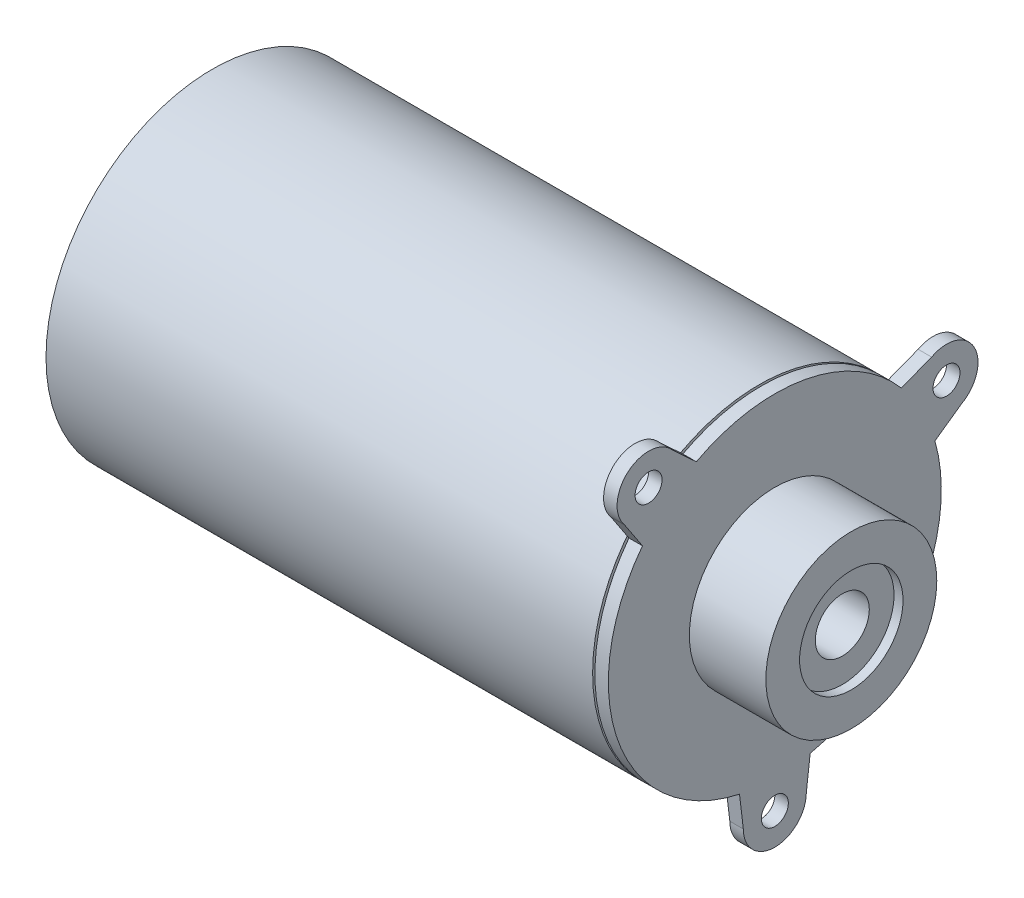
ISO-10303-21;
HEADER;
FILE_DESCRIPTION(('STEP AP214'),'2;1');
FILE_NAME('part.step','',(''),(''),'','','');
FILE_SCHEMA(('AUTOMOTIVE_DESIGN { 1 0 10303 214 1 1 1 1 }'));
ENDSEC;
DATA;
#1=APPLICATION_CONTEXT('core data for automotive mechanical design processes');
#2=APPLICATION_PROTOCOL_DEFINITION('international standard','automotive_design',2000,#1);
#3=PRODUCT_CONTEXT('',#1,'mechanical');
#4=PRODUCT('Part','Part','',(#3));
#5=PRODUCT_RELATED_PRODUCT_CATEGORY('part','',(#4));
#6=PRODUCT_DEFINITION_FORMATION('','',#4);
#7=PRODUCT_DEFINITION_CONTEXT('part definition',#1,'design');
#8=PRODUCT_DEFINITION('design','',#6,#7);
#9=PRODUCT_DEFINITION_SHAPE('','',#8);
#10=(LENGTH_UNIT() NAMED_UNIT(*) SI_UNIT(.MILLI.,.METRE.));
#11=(NAMED_UNIT(*) PLANE_ANGLE_UNIT() SI_UNIT($,.RADIAN.));
#12=(NAMED_UNIT(*) SI_UNIT($,.STERADIAN.) SOLID_ANGLE_UNIT());
#13=UNCERTAINTY_MEASURE_WITH_UNIT(LENGTH_MEASURE(1.E-05),#10,'distance_accuracy_value','');
#14=(GEOMETRIC_REPRESENTATION_CONTEXT(3) GLOBAL_UNCERTAINTY_ASSIGNED_CONTEXT((#13)) GLOBAL_UNIT_ASSIGNED_CONTEXT((#10,
#11,#12)) REPRESENTATION_CONTEXT('',''));
#15=CARTESIAN_POINT('',(0.,0.,0.));
#16=DIRECTION('',(0.,0.,1.));
#17=DIRECTION('',(1.,0.,0.));
#18=AXIS2_PLACEMENT_3D('',#15,#16,#17);
#19=CARTESIAN_POINT('',(1.5,0.,0.));
#20=DIRECTION('',(-1.,0.,0.));
#21=DIRECTION('',(0.,0.,1.));
#22=AXIS2_PLACEMENT_3D('',#19,#20,#21);
#23=CYLINDRICAL_SURFACE('',#22,18.5);
#24=CARTESIAN_POINT('',(-0.25,0.,0.));
#25=DIRECTION('',(1.,0.,0.));
#26=DIRECTION('',(0.,0.,-1.));
#27=AXIS2_PLACEMENT_3D('',#24,#25,#26);
#28=CIRCLE('',#27,18.5);
#29=CARTESIAN_POINT('',(-0.25,0.,-18.5));
#30=VERTEX_POINT('',#29);
#31=EDGE_CURVE('E208',#30,#30,#28,.T.);
#32=ORIENTED_EDGE('',*,*,#31,.F.);
#33=EDGE_LOOP('',(#32));
#34=FACE_BOUND('',#33,.T.);
#35=CARTESIAN_POINT('',(-61.,0.,0.));
#36=DIRECTION('',(-1.,0.,0.));
#37=DIRECTION('',(0.,0.,1.));
#38=AXIS2_PLACEMENT_3D('',#35,#36,#37);
#39=CIRCLE('',#38,18.5);
#40=CARTESIAN_POINT('',(-61.,0.,18.5));
#41=VERTEX_POINT('',#40);
#42=EDGE_CURVE('E576',#41,#41,#39,.T.);
#43=ORIENTED_EDGE('',*,*,#42,.F.);
#44=EDGE_LOOP('',(#43));
#45=FACE_BOUND('',#44,.T.);
#46=ADVANCED_FACE('F35',(#34,#45),#23,.T.);
#47=CARTESIAN_POINT('',(-55.5,0.,0.));
#48=DIRECTION('',(-1.,0.,0.));
#49=DIRECTION('',(0.,0.,1.));
#50=AXIS2_PLACEMENT_3D('',#47,#48,#49);
#51=CYLINDRICAL_SURFACE('',#50,17.5);
#52=CARTESIAN_POINT('',(-55.5,0.,0.));
#53=DIRECTION('',(1.,0.,0.));
#54=DIRECTION('',(0.,0.,-1.));
#55=AXIS2_PLACEMENT_3D('',#52,#53,#54);
#56=CIRCLE('',#55,17.5);
#57=CARTESIAN_POINT('',(-55.5,0.,-17.5));
#58=VERTEX_POINT('',#57);
#59=EDGE_CURVE('E153',#58,#58,#56,.T.);
#60=ORIENTED_EDGE('',*,*,#59,.T.);
#61=EDGE_LOOP('',(#60));
#62=FACE_BOUND('',#61,.T.);
#63=CARTESIAN_POINT('',(-61.,0.,0.));
#64=DIRECTION('',(-1.,0.,0.));
#65=DIRECTION('',(0.,0.,1.));
#66=AXIS2_PLACEMENT_3D('',#63,#64,#65);
#67=CIRCLE('',#66,17.5);
#68=CARTESIAN_POINT('',(-61.,0.,17.5));
#69=VERTEX_POINT('',#68);
#70=EDGE_CURVE('E39',#69,#69,#67,.T.);
#71=ORIENTED_EDGE('',*,*,#70,.T.);
#72=EDGE_LOOP('',(#71));
#73=FACE_BOUND('',#72,.T.);
#74=ADVANCED_FACE('F314',(#62,#73),#51,.F.);
#75=DIRECTION('',(-1.,0.,0.));
#76=VECTOR('',#75,1.);
#77=CARTESIAN_POINT('',(1.5,12.0220592013909,-14.0612976840067));
#78=LINE('',#77,#76);
#79=CARTESIAN_POINT('',(1.5,12.0220592013909,-14.0612976840067));
#80=VERTEX_POINT('',#79);
#81=CARTESIAN_POINT('',(0.,12.0220592013909,-14.0612976840067));
#82=VERTEX_POINT('',#81);
#83=EDGE_CURVE('E196',#80,#82,#78,.T.);
#84=ORIENTED_EDGE('',*,*,#83,.T.);
#85=CARTESIAN_POINT('',(0.,0.,0.));
#86=DIRECTION('',(1.,0.,0.));
#87=DIRECTION('',(0.,0.,-1.));
#88=AXIS2_PLACEMENT_3D('',#85,#86,#87);
#89=CIRCLE('',#88,18.5);
#90=CARTESIAN_POINT('',(0.,16.3147658101459,8.72229422572375));
#91=VERTEX_POINT('',#90);
#92=EDGE_CURVE('E215',#82,#91,#89,.T.);
#93=ORIENTED_EDGE('',*,*,#92,.T.);
#94=DIRECTION('',(-1.,0.,0.));
#95=VECTOR('',#94,1.);
#96=CARTESIAN_POINT('',(1.5,16.3147658101459,8.72229422572375));
#97=LINE('',#96,#95);
#98=CARTESIAN_POINT('',(1.5,16.3147658101459,8.72229422572375));
#99=VERTEX_POINT('',#98);
#100=EDGE_CURVE('E193',#99,#91,#97,.T.);
#101=ORIENTED_EDGE('',*,*,#100,.F.);
#102=CARTESIAN_POINT('',(1.5,0.,0.));
#103=DIRECTION('',(1.,0.,0.));
#104=DIRECTION('',(0.,0.,-1.));
#105=AXIS2_PLACEMENT_3D('',#102,#103,#104);
#106=CIRCLE('',#105,18.5);
#107=EDGE_CURVE('E240',#80,#99,#106,.T.);
#108=ORIENTED_EDGE('',*,*,#107,.F.);
#109=EDGE_LOOP('',(#84,#93,#101,#108));
#110=FACE_BOUND('',#109,.T.);
#111=ADVANCED_FACE('F259',(#110),#23,.T.);
#112=DIRECTION('',(-1.,0.,0.));
#113=VECTOR('',#112,1.);
#114=CARTESIAN_POINT('',(1.5,11.2185170794891,14.7103662271614));
#115=LINE('',#114,#113);
#116=CARTESIAN_POINT('',(1.5,11.2185170794891,14.7103662271614));
#117=VERTEX_POINT('',#116);
#118=CARTESIAN_POINT('',(0.,11.2185170794891,14.7103662271614));
#119=VERTEX_POINT('',#118);
#120=EDGE_CURVE('E184',#117,#119,#115,.T.);
#121=ORIENTED_EDGE('',*,*,#120,.T.);
#122=CARTESIAN_POINT('',(0.,-18.0782272315908,3.92781111599948));
#123=VERTEX_POINT('',#122);
#124=EDGE_CURVE('E220',#119,#123,#89,.T.);
#125=ORIENTED_EDGE('',*,*,#124,.T.);
#126=DIRECTION('',(-1.,0.,0.));
#127=VECTOR('',#126,1.);
#128=CARTESIAN_POINT('',(1.5,-18.0782272315908,3.92781111599948));
#129=LINE('',#128,#127);
#130=CARTESIAN_POINT('',(1.5,-18.0782272315908,3.92781111599948));
#131=VERTEX_POINT('',#130);
#132=EDGE_CURVE('E132',#131,#123,#129,.T.);
#133=ORIENTED_EDGE('',*,*,#132,.F.);
#134=EDGE_CURVE('E127',#117,#131,#106,.T.);
#135=ORIENTED_EDGE('',*,*,#134,.F.);
#136=EDGE_LOOP('',(#121,#125,#133,#135));
#137=FACE_BOUND('',#136,.T.);
#138=ADVANCED_FACE('F276',(#137),#23,.T.);
#139=CARTESIAN_POINT('',(1.5,-5.03690467349999,-3.57654560553015));
#140=DIRECTION('',(0.,0.815356752268375,0.57895886428171));
#141=DIRECTION('',(0.,-0.57895886428171,0.815356752268375));
#142=AXIS2_PLACEMENT_3D('',#139,#140,#141);
#143=PLANE('',#142);
#144=DIRECTION('',(0.,0.57895886428171,-0.815356752268375));
#145=VECTOR('',#144,1.);
#146=CARTESIAN_POINT('',(0.,-5.03690467349999,-3.57654560553015));
#147=LINE('',#146,#145);
#148=CARTESIAN_POINT('',(0.,5.05904754640385,-17.7948317756371));
#149=VERTEX_POINT('',#148);
#150=CARTESIAN_POINT('',(0.,7.14616197718739,-20.7341474142489));
#151=VERTEX_POINT('',#150);
#152=EDGE_CURVE('E150',#149,#151,#147,.T.);
#153=ORIENTED_EDGE('',*,*,#152,.T.);
#154=DIRECTION('',(-1.,0.,0.));
#155=VECTOR('',#154,1.);
#156=CARTESIAN_POINT('',(1.5,7.14616197718739,-20.7341474142489));
#157=LINE('',#156,#155);
#158=CARTESIAN_POINT('',(1.5,7.14616197718739,-20.7341474142489));
#159=VERTEX_POINT('',#158);
#160=EDGE_CURVE('E202',#159,#151,#157,.T.);
#161=ORIENTED_EDGE('',*,*,#160,.F.);
#162=DIRECTION('',(0.,0.57895886428171,-0.815356752268375));
#163=VECTOR('',#162,1.);
#164=CARTESIAN_POINT('',(1.5,-5.03690467349999,-3.57654560553015));
#165=LINE('',#164,#163);
#166=CARTESIAN_POINT('',(1.5,5.05904754640385,-17.7948317756371));
#167=VERTEX_POINT('',#166);
#168=EDGE_CURVE('E94',#167,#159,#165,.T.);
#169=ORIENTED_EDGE('',*,*,#168,.F.);
#170=DIRECTION('',(-1.,0.,0.));
#171=VECTOR('',#170,1.);
#172=CARTESIAN_POINT('',(1.5,5.05904754640385,-17.7948317756371));
#173=LINE('',#172,#171);
#174=EDGE_CURVE('E45',#167,#149,#173,.T.);
#175=ORIENTED_EDGE('',*,*,#174,.T.);
#176=EDGE_LOOP('',(#153,#161,#169,#175));
#177=FACE_BOUND('',#176,.T.);
#178=ADVANCED_FACE('F37',(#177),#143,.F.);
#179=CARTESIAN_POINT('',(1.5,10.230724059415,-19.0802197372071));
#180=DIRECTION('',(-1.,0.,0.));
#181=DIRECTION('',(0.,0.,1.));
#182=AXIS2_PLACEMENT_3D('',#179,#180,#181);
#183=CYLINDRICAL_SURFACE('',#182,3.50000000000011);
#184=CARTESIAN_POINT('',(0.,10.230724059415,-19.0802197372071));
#185=DIRECTION('',(1.,0.,0.));
#186=DIRECTION('',(0.,0.,-1.));
#187=AXIS2_PLACEMENT_3D('',#184,#185,#186);
#188=CIRCLE('',#187,3.50000000000011);
#189=CARTESIAN_POINT('',(0.,13.3152861416425,-17.4262920601654));
#190=VERTEX_POINT('',#189);
#191=EDGE_CURVE('E152',#151,#190,#188,.T.);
#192=ORIENTED_EDGE('',*,*,#191,.T.);
#193=DIRECTION('',(-1.,0.,0.));
#194=VECTOR('',#193,1.);
#195=CARTESIAN_POINT('',(1.5,13.3152861416425,-17.4262920601654));
#196=LINE('',#195,#194);
#197=CARTESIAN_POINT('',(1.5,13.3152861416425,-17.4262920601654));
#198=VERTEX_POINT('',#197);
#199=EDGE_CURVE('E199',#198,#190,#196,.T.);
#200=ORIENTED_EDGE('',*,*,#199,.F.);
#201=CARTESIAN_POINT('',(1.5,10.230724059415,-19.0802197372071));
#202=DIRECTION('',(1.,0.,0.));
#203=DIRECTION('',(0.,0.,-1.));
#204=AXIS2_PLACEMENT_3D('',#201,#202,#203);
#205=CIRCLE('',#204,3.50000000000011);
#206=EDGE_CURVE('E242',#159,#198,#205,.T.);
#207=ORIENTED_EDGE('',*,*,#206,.F.);
#208=ORIENTED_EDGE('',*,*,#160,.T.);
#209=EDGE_LOOP('',(#192,#200,#207,#208));
#210=FACE_BOUND('',#209,.T.);
#211=ADVANCED_FACE('F296',(#210),#183,.T.);
#212=CARTESIAN_POINT('',(1.5,5.76636128387364,2.21611477640626));
#213=DIRECTION('',(0.,-0.933438671881452,-0.358737014867703));
#214=DIRECTION('',(0.,0.358737014867703,-0.933438671881452));
#215=AXIS2_PLACEMENT_3D('',#212,#213,#214);
#216=PLANE('',#215);
#217=DIRECTION('',(0.,-0.358737014867703,0.933438671881452));
#218=VECTOR('',#217,1.);
#219=CARTESIAN_POINT('',(0.,5.76636128387364,2.21611477640626));
#220=LINE('',#219,#218);
#221=EDGE_CURVE('E155',#190,#82,#220,.T.);
#222=ORIENTED_EDGE('',*,*,#221,.T.);
#223=ORIENTED_EDGE('',*,*,#83,.F.);
#224=DIRECTION('',(0.,-0.358737014867703,0.933438671881452));
#225=VECTOR('',#224,1.);
#226=CARTESIAN_POINT('',(1.5,5.76636128387364,2.21611477640626));
#227=LINE('',#226,#225);
#228=EDGE_CURVE('E244',#198,#80,#227,.T.);
#229=ORIENTED_EDGE('',*,*,#228,.F.);
#230=ORIENTED_EDGE('',*,*,#199,.T.);
#231=EDGE_LOOP('',(#222,#223,#229,#230));
#232=FACE_BOUND('',#231,.T.);
#233=ADVANCED_FACE('F299',(#232),#216,.F.);
#234=CARTESIAN_POINT('',(1.5,4.46090595065169,-4.11815463465439));
#235=DIRECTION('',(0.,-0.734770992556157,0.678315257456324));
#236=DIRECTION('',(0.,-0.678315257456324,-0.734770992556157));
#237=AXIS2_PLACEMENT_3D('',#234,#235,#236);
#238=PLANE('',#237);
#239=DIRECTION('',(0.,0.678315257456324,0.734770992556157));
#240=VECTOR('',#239,1.);
#241=CARTESIAN_POINT('',(0.,4.46090595065169,-4.11815463465439));
#242=LINE('',#241,#240);
#243=CARTESIAN_POINT('',(0.,18.7557240118914,11.3664117816378));
#244=VERTEX_POINT('',#243);
#245=EDGE_CURVE('E158',#91,#244,#242,.T.);
#246=ORIENTED_EDGE('',*,*,#245,.T.);
#247=DIRECTION('',(-1.,0.,0.));
#248=VECTOR('',#247,1.);
#249=CARTESIAN_POINT('',(1.5,18.7557240118914,11.3664117816378));
#250=LINE('',#249,#248);
#251=CARTESIAN_POINT('',(1.5,18.7557240118914,11.3664117816378));
#252=VERTEX_POINT('',#251);
#253=EDGE_CURVE('E190',#252,#244,#250,.T.);
#254=ORIENTED_EDGE('',*,*,#253,.F.);
#255=DIRECTION('',(0.,0.678315257456324,0.734770992556157));
#256=VECTOR('',#255,1.);
#257=CARTESIAN_POINT('',(1.5,4.46090595065169,-4.11815463465439));
#258=LINE('',#257,#256);
#259=EDGE_CURVE('E246',#99,#252,#258,.T.);
#260=ORIENTED_EDGE('',*,*,#259,.F.);
#261=ORIENTED_EDGE('',*,*,#100,.T.);
#262=EDGE_LOOP('',(#246,#254,#260,#261));
#263=FACE_BOUND('',#262,.T.);
#264=ADVANCED_FACE('F264',(#263),#238,.F.);
#265=CARTESIAN_POINT('',(1.5,16.4873043581704,14.0317958580166));
#266=DIRECTION('',(-1.,0.,0.));
#267=DIRECTION('',(0.,0.,1.));
#268=AXIS2_PLACEMENT_3D('',#265,#266,#267);
#269=CYLINDRICAL_SURFACE('',#268,3.50000000000023);
#270=CARTESIAN_POINT('',(0.,16.4873043581704,14.0317958580166));
#271=DIRECTION('',(1.,0.,0.));
#272=DIRECTION('',(0.,0.,-1.));
#273=AXIS2_PLACEMENT_3D('',#270,#271,#272);
#274=CIRCLE('',#273,3.50000000000023);
#275=CARTESIAN_POINT('',(0.,14.2188847044493,16.6971799343954));
#276=VERTEX_POINT('',#275);
#277=EDGE_CURVE('E160',#244,#276,#274,.T.);
#278=ORIENTED_EDGE('',*,*,#277,.T.);
#279=DIRECTION('',(-1.,0.,0.));
#280=VECTOR('',#279,1.);
#281=CARTESIAN_POINT('',(1.5,14.2188847044493,16.6971799343954));
#282=LINE('',#281,#280);
#283=CARTESIAN_POINT('',(1.5,14.2188847044493,16.6971799343954));
#284=VERTEX_POINT('',#283);
#285=EDGE_CURVE('E187',#284,#276,#282,.T.);
#286=ORIENTED_EDGE('',*,*,#285,.F.);
#287=CARTESIAN_POINT('',(1.5,16.4873043581704,14.0317958580166));
#288=DIRECTION('',(1.,0.,0.));
#289=DIRECTION('',(0.,0.,-1.));
#290=AXIS2_PLACEMENT_3D('',#287,#288,#289);
#291=CIRCLE('',#290,3.50000000000023);
#292=EDGE_CURVE('E248',#252,#284,#291,.T.);
#293=ORIENTED_EDGE('',*,*,#292,.F.);
#294=ORIENTED_EDGE('',*,*,#253,.T.);
#295=EDGE_LOOP('',(#278,#286,#293,#294));
#296=FACE_BOUND('',#295,.T.);
#297=ADVANCED_FACE('F269',(#296),#269,.T.);
#298=CARTESIAN_POINT('',(1.5,-3.35196484347388,5.06193749305523));
#299=DIRECTION('',(0.,0.552113530816067,-0.83376894226747));
#300=DIRECTION('',(0.,0.83376894226747,0.552113530816067));
#301=AXIS2_PLACEMENT_3D('',#298,#299,#300);
#302=PLANE('',#301);
#303=DIRECTION('',(0.,-0.83376894226747,-0.552113530816067));
#304=VECTOR('',#303,1.);
#305=CARTESIAN_POINT('',(0.,-3.35196484347388,5.06193749305523));
#306=LINE('',#305,#304);
#307=EDGE_CURVE('E162',#276,#119,#306,.T.);
#308=ORIENTED_EDGE('',*,*,#307,.T.);
#309=ORIENTED_EDGE('',*,*,#120,.F.);
#310=DIRECTION('',(0.,-0.83376894226747,-0.552113530816067));
#311=VECTOR('',#310,1.);
#312=CARTESIAN_POINT('',(1.5,-3.35196484347388,5.06193749305523));
#313=LINE('',#312,#311);
#314=EDGE_CURVE('E249',#284,#117,#313,.T.);
#315=ORIENTED_EDGE('',*,*,#314,.F.);
#316=ORIENTED_EDGE('',*,*,#285,.T.);
#317=EDGE_LOOP('',(#308,#309,#315,#316));
#318=FACE_BOUND('',#317,.T.);
#319=ADVANCED_FACE('F272',(#318),#302,.F.);
#320=DIRECTION('',(-1.,0.,0.));
#321=VECTOR('',#320,1.);
#322=CARTESIAN_POINT('',(1.5,-18.0782272315907,-3.92781111599967));
#323=LINE('',#322,#321);
#324=CARTESIAN_POINT('',(1.5,-18.0782272315907,-3.92781111599967));
#325=VERTEX_POINT('',#324);
#326=CARTESIAN_POINT('',(0.,-18.0782272315908,-3.92781111599967));
#327=VERTEX_POINT('',#326);
#328=EDGE_CURVE('E149',#325,#327,#323,.T.);
#329=ORIENTED_EDGE('',*,*,#328,.T.);
#330=EDGE_CURVE('E222',#327,#149,#89,.T.);
#331=ORIENTED_EDGE('',*,*,#330,.T.);
#332=ORIENTED_EDGE('',*,*,#174,.F.);
#333=EDGE_CURVE('E179',#325,#167,#106,.T.);
#334=ORIENTED_EDGE('',*,*,#333,.F.);
#335=EDGE_LOOP('',(#329,#331,#332,#334));
#336=FACE_BOUND('',#335,.T.);
#337=ADVANCED_FACE('F289',(#336),#23,.T.);
#338=CARTESIAN_POINT('',(1.5,-0.719487536599334,6.00696404166786));
#339=DIRECTION('',(0.,0.118925542857744,-0.992903175166638));
#340=DIRECTION('',(0.,0.992903175166638,0.118925542857745));
#341=AXIS2_PLACEMENT_3D('',#338,#339,#340);
#342=PLANE('',#341);
#343=DIRECTION('',(0.,-0.992903175166638,-0.118925542857744));
#344=VECTOR('',#343,1.);
#345=CARTESIAN_POINT('',(0.,-0.719487536599334,6.00696404166786));
#346=LINE('',#345,#344);
#347=CARTESIAN_POINT('',(0.,-21.65,3.49999999999989));
#348=VERTEX_POINT('',#347);
#349=EDGE_CURVE('E78',#123,#348,#346,.T.);
#350=ORIENTED_EDGE('',*,*,#349,.T.);
#351=DIRECTION('',(-1.,0.,0.));
#352=VECTOR('',#351,1.);
#353=CARTESIAN_POINT('',(1.5,-21.65,3.49999999999989));
#354=LINE('',#353,#352);
#355=CARTESIAN_POINT('',(1.5,-21.65,3.49999999999989));
#356=VERTEX_POINT('',#355);
#357=EDGE_CURVE('E130',#356,#348,#354,.T.);
#358=ORIENTED_EDGE('',*,*,#357,.F.);
#359=DIRECTION('',(0.,-0.992903175166638,-0.118925542857744));
#360=VECTOR('',#359,1.);
#361=CARTESIAN_POINT('',(1.5,-0.719487536599334,6.00696404166786));
#362=LINE('',#361,#360);
#363=EDGE_CURVE('E121',#131,#356,#362,.T.);
#364=ORIENTED_EDGE('',*,*,#363,.F.);
#365=ORIENTED_EDGE('',*,*,#132,.T.);
#366=EDGE_LOOP('',(#350,#358,#364,#365));
#367=FACE_BOUND('',#366,.T.);
#368=ADVANCED_FACE('F131',(#367),#342,.F.);
#369=CARTESIAN_POINT('',(1.5,-21.65,-1.11022302462516E-13));
#370=DIRECTION('',(-1.,0.,0.));
#371=DIRECTION('',(0.,0.,1.));
#372=AXIS2_PLACEMENT_3D('',#369,#370,#371);
#373=CYLINDRICAL_SURFACE('',#372,3.5);
#374=CARTESIAN_POINT('',(0.,-21.65,-1.11022302462516E-13));
#375=DIRECTION('',(1.,0.,0.));
#376=DIRECTION('',(0.,0.,-1.));
#377=AXIS2_PLACEMENT_3D('',#374,#375,#376);
#378=CIRCLE('',#377,3.5);
#379=CARTESIAN_POINT('',(0.,-21.65,-3.50000000000011));
#380=VERTEX_POINT('',#379);
#381=EDGE_CURVE('E85',#348,#380,#378,.T.);
#382=ORIENTED_EDGE('',*,*,#381,.T.);
#383=DIRECTION('',(-1.,0.,0.));
#384=VECTOR('',#383,1.);
#385=CARTESIAN_POINT('',(1.5,-21.65,-3.50000000000011));
#386=LINE('',#385,#384);
#387=CARTESIAN_POINT('',(1.5,-21.65,-3.50000000000011));
#388=VERTEX_POINT('',#387);
#389=EDGE_CURVE('E133',#388,#380,#386,.T.);
#390=ORIENTED_EDGE('',*,*,#389,.F.);
#391=CARTESIAN_POINT('',(1.5,-21.65,-1.11022302462516E-13));
#392=DIRECTION('',(1.,0.,0.));
#393=DIRECTION('',(0.,0.,-1.));
#394=AXIS2_PLACEMENT_3D('',#391,#392,#393);
#395=CIRCLE('',#394,3.5);
#396=EDGE_CURVE('E125',#356,#388,#395,.T.);
#397=ORIENTED_EDGE('',*,*,#396,.F.);
#398=ORIENTED_EDGE('',*,*,#357,.T.);
#399=EDGE_LOOP('',(#382,#390,#397,#398));
#400=FACE_BOUND('',#399,.T.);
#401=ADVANCED_FACE('F135',(#400),#373,.T.);
#402=CARTESIAN_POINT('',(1.5,16.4873043581704,14.0317958580166));
#403=DIRECTION('',(-1.,0.,0.));
#404=DIRECTION('',(0.,0.,1.));
#405=AXIS2_PLACEMENT_3D('',#402,#403,#404);
#406=CYLINDRICAL_SURFACE('',#405,1.5);
#407=CARTESIAN_POINT('',(1.5,16.4873043581704,14.0317958580166));
#408=DIRECTION('',(1.,0.,0.));
#409=DIRECTION('',(0.,0.,-1.));
#410=AXIS2_PLACEMENT_3D('',#407,#408,#409);
#411=CIRCLE('',#410,1.5);
#412=CARTESIAN_POINT('',(1.5,16.4873043581704,12.5317958580166));
#413=VERTEX_POINT('',#412);
#414=EDGE_CURVE('E143',#413,#413,#411,.T.);
#415=ORIENTED_EDGE('',*,*,#414,.T.);
#416=EDGE_LOOP('',(#415));
#417=FACE_BOUND('',#416,.T.);
#418=CARTESIAN_POINT('',(0.,16.4873043581704,14.0317958580166));
#419=DIRECTION('',(1.,0.,0.));
#420=DIRECTION('',(0.,0.,-1.));
#421=AXIS2_PLACEMENT_3D('',#418,#419,#420);
#422=CIRCLE('',#421,1.5);
#423=CARTESIAN_POINT('',(0.,16.4873043581704,12.5317958580166));
#424=VERTEX_POINT('',#423);
#425=EDGE_CURVE('E173',#424,#424,#422,.T.);
#426=ORIENTED_EDGE('',*,*,#425,.F.);
#427=EDGE_LOOP('',(#426));
#428=FACE_BOUND('',#427,.T.);
#429=ADVANCED_FACE('F387',(#417,#428),#406,.F.);
#430=CARTESIAN_POINT('',(1.5,-21.65,-1.11022302462516E-13));
#431=DIRECTION('',(-1.,0.,0.));
#432=DIRECTION('',(0.,0.,1.));
#433=AXIS2_PLACEMENT_3D('',#430,#431,#432);
#434=CYLINDRICAL_SURFACE('',#433,1.5);
#435=CARTESIAN_POINT('',(1.5,-21.65,-1.11022302462516E-13));
#436=DIRECTION('',(1.,0.,0.));
#437=DIRECTION('',(0.,0.,-1.));
#438=AXIS2_PLACEMENT_3D('',#435,#436,#437);
#439=CIRCLE('',#438,1.5);
#440=CARTESIAN_POINT('',(1.5,-21.65,-1.50000000000011));
#441=VERTEX_POINT('',#440);
#442=EDGE_CURVE('E137',#441,#441,#439,.T.);
#443=ORIENTED_EDGE('',*,*,#442,.T.);
#444=EDGE_LOOP('',(#443));
#445=FACE_BOUND('',#444,.T.);
#446=CARTESIAN_POINT('',(0.,-21.65,-1.11022302462516E-13));
#447=DIRECTION('',(1.,0.,0.));
#448=DIRECTION('',(0.,0.,-1.));
#449=AXIS2_PLACEMENT_3D('',#446,#447,#448);
#450=CIRCLE('',#449,1.5);
#451=CARTESIAN_POINT('',(0.,-21.65,-1.50000000000011));
#452=VERTEX_POINT('',#451);
#453=EDGE_CURVE('E170',#452,#452,#450,.T.);
#454=ORIENTED_EDGE('',*,*,#453,.F.);
#455=EDGE_LOOP('',(#454));
#456=FACE_BOUND('',#455,.T.);
#457=ADVANCED_FACE('F393',(#445,#456),#434,.F.);
#458=CARTESIAN_POINT('',(1.5,-0.719487536599278,-6.00696404166788));
#459=DIRECTION('',(0.,0.118925542857735,0.992903175166639));
#460=DIRECTION('',(0.,-0.992903175166639,0.118925542857735));
#461=AXIS2_PLACEMENT_3D('',#458,#459,#460);
#462=PLANE('',#461);
#463=DIRECTION('',(0.,0.992903175166639,-0.118925542857735));
#464=VECTOR('',#463,1.);
#465=CARTESIAN_POINT('',(0.,-0.719487536599278,-6.00696404166788));
#466=LINE('',#465,#464);
#467=EDGE_CURVE('E167',#380,#327,#466,.T.);
#468=ORIENTED_EDGE('',*,*,#467,.T.);
#469=ORIENTED_EDGE('',*,*,#328,.F.);
#470=DIRECTION('',(0.,0.992903175166639,-0.118925542857735));
#471=VECTOR('',#470,1.);
#472=CARTESIAN_POINT('',(1.5,-0.719487536599278,-6.00696404166788));
#473=LINE('',#472,#471);
#474=EDGE_CURVE('E54',#388,#325,#473,.T.);
#475=ORIENTED_EDGE('',*,*,#474,.F.);
#476=ORIENTED_EDGE('',*,*,#389,.T.);
#477=EDGE_LOOP('',(#468,#469,#475,#476));
#478=FACE_BOUND('',#477,.T.);
#479=ADVANCED_FACE('F286',(#478),#462,.F.);
#480=CARTESIAN_POINT('',(1.5,10.230724059415,-19.0802197372071));
#481=DIRECTION('',(-1.,0.,0.));
#482=DIRECTION('',(0.,0.,1.));
#483=AXIS2_PLACEMENT_3D('',#480,#481,#482);
#484=CYLINDRICAL_SURFACE('',#483,1.5);
#485=CARTESIAN_POINT('',(1.5,10.230724059415,-19.0802197372071));
#486=DIRECTION('',(1.,0.,0.));
#487=DIRECTION('',(0.,0.,-1.));
#488=AXIS2_PLACEMENT_3D('',#485,#486,#487);
#489=CIRCLE('',#488,1.5);
#490=CARTESIAN_POINT('',(1.5,10.230724059415,-20.5802197372071));
#491=VERTEX_POINT('',#490);
#492=EDGE_CURVE('E146',#491,#491,#489,.T.);
#493=ORIENTED_EDGE('',*,*,#492,.T.);
#494=EDGE_LOOP('',(#493));
#495=FACE_BOUND('',#494,.T.);
#496=CARTESIAN_POINT('',(0.,10.230724059415,-19.0802197372071));
#497=DIRECTION('',(1.,0.,0.));
#498=DIRECTION('',(0.,0.,-1.));
#499=AXIS2_PLACEMENT_3D('',#496,#497,#498);
#500=CIRCLE('',#499,1.5);
#501=CARTESIAN_POINT('',(0.,10.230724059415,-20.5802197372071));
#502=VERTEX_POINT('',#501);
#503=EDGE_CURVE('E176',#502,#502,#500,.T.);
#504=ORIENTED_EDGE('',*,*,#503,.F.);
#505=EDGE_LOOP('',(#504));
#506=FACE_BOUND('',#505,.T.);
#507=ADVANCED_FACE('F409',(#495,#506),#484,.F.);
#508=CARTESIAN_POINT('',(1.5,0.,0.));
#509=DIRECTION('',(1.,0.,0.));
#510=DIRECTION('',(0.,0.,-1.));
#511=AXIS2_PLACEMENT_3D('',#508,#509,#510);
#512=PLANE('',#511);
#513=CARTESIAN_POINT('',(1.5,0.,0.));
#514=DIRECTION('',(1.,0.,0.));
#515=DIRECTION('',(0.,0.,-1.));
#516=AXIS2_PLACEMENT_3D('',#513,#514,#515);
#517=CIRCLE('',#516,9.5);
#518=CARTESIAN_POINT('',(1.5,0.,-9.5));
#519=VERTEX_POINT('',#518);
#520=EDGE_CURVE('E11',#519,#519,#517,.T.);
#521=ORIENTED_EDGE('',*,*,#520,.F.);
#522=EDGE_LOOP('',(#521));
#523=FACE_BOUND('',#522,.T.);
#524=ORIENTED_EDGE('',*,*,#333,.T.);
#525=ORIENTED_EDGE('',*,*,#168,.T.);
#526=ORIENTED_EDGE('',*,*,#206,.T.);
#527=ORIENTED_EDGE('',*,*,#228,.T.);
#528=ORIENTED_EDGE('',*,*,#107,.T.);
#529=ORIENTED_EDGE('',*,*,#259,.T.);
#530=ORIENTED_EDGE('',*,*,#292,.T.);
#531=ORIENTED_EDGE('',*,*,#314,.T.);
#532=ORIENTED_EDGE('',*,*,#134,.T.);
#533=ORIENTED_EDGE('',*,*,#363,.T.);
#534=ORIENTED_EDGE('',*,*,#396,.T.);
#535=ORIENTED_EDGE('',*,*,#474,.T.);
#536=EDGE_LOOP('',(#524,#525,#526,#527,#528,#529,#530,#531,#532,#533,#534,#535));
#537=FACE_BOUND('',#536,.T.);
#538=ORIENTED_EDGE('',*,*,#442,.F.);
#539=EDGE_LOOP('',(#538));
#540=FACE_BOUND('',#539,.T.);
#541=ORIENTED_EDGE('',*,*,#414,.F.);
#542=EDGE_LOOP('',(#541));
#543=FACE_BOUND('',#542,.T.);
#544=ORIENTED_EDGE('',*,*,#492,.F.);
#545=EDGE_LOOP('',(#544));
#546=FACE_BOUND('',#545,.T.);
#547=ADVANCED_FACE('F122',(#523,#537,#540,#543,#546),#512,.T.);
#548=CARTESIAN_POINT('',(0.,0.,0.));
#549=DIRECTION('',(1.,0.,0.));
#550=DIRECTION('',(0.,0.,-1.));
#551=AXIS2_PLACEMENT_3D('',#548,#549,#550);
#552=PLANE('',#551);
#553=ORIENTED_EDGE('',*,*,#349,.F.);
#554=ORIENTED_EDGE('',*,*,#124,.F.);
#555=ORIENTED_EDGE('',*,*,#307,.F.);
#556=ORIENTED_EDGE('',*,*,#277,.F.);
#557=ORIENTED_EDGE('',*,*,#245,.F.);
#558=ORIENTED_EDGE('',*,*,#92,.F.);
#559=ORIENTED_EDGE('',*,*,#221,.F.);
#560=ORIENTED_EDGE('',*,*,#191,.F.);
#561=ORIENTED_EDGE('',*,*,#152,.F.);
#562=ORIENTED_EDGE('',*,*,#330,.F.);
#563=ORIENTED_EDGE('',*,*,#467,.F.);
#564=ORIENTED_EDGE('',*,*,#381,.F.);
#565=EDGE_LOOP('',(#553,#554,#555,#556,#557,#558,#559,#560,#561,#562,#563,#564));
#566=FACE_BOUND('',#565,.T.);
#567=ORIENTED_EDGE('',*,*,#453,.T.);
#568=EDGE_LOOP('',(#567));
#569=FACE_BOUND('',#568,.T.);
#570=CARTESIAN_POINT('',(0.,0.,0.));
#571=DIRECTION('',(1.,0.,0.));
#572=DIRECTION('',(0.,0.,-1.));
#573=AXIS2_PLACEMENT_3D('',#570,#571,#572);
#574=CIRCLE('',#573,17.5);
#575=CARTESIAN_POINT('',(0.,0.,-17.5));
#576=VERTEX_POINT('',#575);
#577=EDGE_CURVE('E224',#576,#576,#574,.T.);
#578=ORIENTED_EDGE('',*,*,#577,.T.);
#579=EDGE_LOOP('',(#578));
#580=FACE_BOUND('',#579,.T.);
#581=ORIENTED_EDGE('',*,*,#425,.T.);
#582=EDGE_LOOP('',(#581));
#583=FACE_BOUND('',#582,.T.);
#584=ORIENTED_EDGE('',*,*,#503,.T.);
#585=EDGE_LOOP('',(#584));
#586=FACE_BOUND('',#585,.T.);
#587=ADVANCED_FACE('F280',(#566,#569,#580,#583,#586),#552,.F.);
#588=CARTESIAN_POINT('',(-55.5,0.,0.));
#589=DIRECTION('',(1.,0.,0.));
#590=DIRECTION('',(0.,0.,-1.));
#591=AXIS2_PLACEMENT_3D('',#588,#589,#590);
#592=PLANE('',#591);
#593=CARTESIAN_POINT('',(-55.5,0.,0.));
#594=DIRECTION('',(1.,0.,0.));
#595=DIRECTION('',(0.,0.,-1.));
#596=AXIS2_PLACEMENT_3D('',#593,#594,#595);
#597=CIRCLE('',#596,3.);
#598=CARTESIAN_POINT('',(-55.5,0.,-3.));
#599=VERTEX_POINT('',#598);
#600=EDGE_CURVE('E207',#599,#599,#597,.T.);
#601=ORIENTED_EDGE('',*,*,#600,.T.);
#602=EDGE_LOOP('',(#601));
#603=FACE_BOUND('',#602,.T.);
#604=ORIENTED_EDGE('',*,*,#59,.F.);
#605=EDGE_LOOP('',(#604));
#606=FACE_BOUND('',#605,.T.);
#607=ADVANCED_FACE('F429',(#603,#606),#592,.F.);
#608=CARTESIAN_POINT('',(10.,0.,0.));
#609=DIRECTION('',(-1.,0.,0.));
#610=DIRECTION('',(0.,0.,1.));
#611=AXIS2_PLACEMENT_3D('',#608,#609,#610);
#612=CYLINDRICAL_SURFACE('',#611,9.5);
#613=CARTESIAN_POINT('',(10.,0.,0.));
#614=DIRECTION('',(1.,0.,0.));
#615=DIRECTION('',(0.,0.,-1.));
#616=AXIS2_PLACEMENT_3D('',#613,#614,#615);
#617=CIRCLE('',#616,9.5);
#618=CARTESIAN_POINT('',(10.,0.,-9.5));
#619=VERTEX_POINT('',#618);
#620=EDGE_CURVE('E232',#619,#619,#617,.T.);
#621=ORIENTED_EDGE('',*,*,#620,.F.);
#622=EDGE_LOOP('',(#621));
#623=FACE_BOUND('',#622,.T.);
#624=ORIENTED_EDGE('',*,*,#520,.T.);
#625=EDGE_LOOP('',(#624));
#626=FACE_BOUND('',#625,.T.);
#627=ADVANCED_FACE('F433',(#623,#626),#612,.T.);
#628=CARTESIAN_POINT('',(10.,0.,0.));
#629=DIRECTION('',(1.,0.,0.));
#630=DIRECTION('',(0.,0.,-1.));
#631=AXIS2_PLACEMENT_3D('',#628,#629,#630);
#632=PLANE('',#631);
#633=CARTESIAN_POINT('',(10.,0.,0.));
#634=DIRECTION('',(1.,0.,0.));
#635=DIRECTION('',(0.,0.,-1.));
#636=AXIS2_PLACEMENT_3D('',#633,#634,#635);
#637=CIRCLE('',#636,5.75);
#638=CARTESIAN_POINT('',(10.,0.,-5.75));
#639=VERTEX_POINT('',#638);
#640=EDGE_CURVE('E212',#639,#639,#637,.T.);
#641=ORIENTED_EDGE('',*,*,#640,.F.);
#642=EDGE_LOOP('',(#641));
#643=FACE_BOUND('',#642,.T.);
#644=ORIENTED_EDGE('',*,*,#620,.T.);
#645=EDGE_LOOP('',(#644));
#646=FACE_BOUND('',#645,.T.);
#647=ADVANCED_FACE('F441',(#643,#646),#632,.T.);
#648=CARTESIAN_POINT('',(9.,0.,0.));
#649=DIRECTION('',(1.,0.,0.));
#650=DIRECTION('',(0.,0.,-1.));
#651=AXIS2_PLACEMENT_3D('',#648,#649,#650);
#652=CYLINDRICAL_SURFACE('',#651,5.75);
#653=CARTESIAN_POINT('',(9.,0.,0.));
#654=DIRECTION('',(1.,0.,0.));
#655=DIRECTION('',(0.,0.,-1.));
#656=AXIS2_PLACEMENT_3D('',#653,#654,#655);
#657=CIRCLE('',#656,5.75);
#658=CARTESIAN_POINT('',(9.,0.,-5.75));
#659=VERTEX_POINT('',#658);
#660=EDGE_CURVE('E229',#659,#659,#657,.T.);
#661=ORIENTED_EDGE('',*,*,#660,.F.);
#662=EDGE_LOOP('',(#661));
#663=FACE_BOUND('',#662,.T.);
#664=ORIENTED_EDGE('',*,*,#640,.T.);
#665=EDGE_LOOP('',(#664));
#666=FACE_BOUND('',#665,.T.);
#667=ADVANCED_FACE('F449',(#663,#666),#652,.F.);
#668=CARTESIAN_POINT('',(9.,0.,0.));
#669=DIRECTION('',(1.,0.,0.));
#670=DIRECTION('',(0.,0.,-1.));
#671=AXIS2_PLACEMENT_3D('',#668,#669,#670);
#672=PLANE('',#671);
#673=CARTESIAN_POINT('',(9.,0.,0.));
#674=DIRECTION('',(1.,0.,0.));
#675=DIRECTION('',(0.,0.,-1.));
#676=AXIS2_PLACEMENT_3D('',#673,#674,#675);
#677=CIRCLE('',#676,3.);
#678=CARTESIAN_POINT('',(9.,0.,-3.));
#679=VERTEX_POINT('',#678);
#680=EDGE_CURVE('E205',#679,#679,#677,.T.);
#681=ORIENTED_EDGE('',*,*,#680,.F.);
#682=EDGE_LOOP('',(#681));
#683=FACE_BOUND('',#682,.T.);
#684=ORIENTED_EDGE('',*,*,#660,.T.);
#685=EDGE_LOOP('',(#684));
#686=FACE_BOUND('',#685,.T.);
#687=ADVANCED_FACE('F456',(#683,#686),#672,.T.);
#688=CARTESIAN_POINT('',(-61.5,0.,0.));
#689=DIRECTION('',(1.,0.,0.));
#690=DIRECTION('',(0.,0.,-1.));
#691=AXIS2_PLACEMENT_3D('',#688,#689,#690);
#692=CYLINDRICAL_SURFACE('',#691,3.);
#693=ORIENTED_EDGE('',*,*,#680,.T.);
#694=EDGE_LOOP('',(#693));
#695=FACE_BOUND('',#694,.T.);
#696=ORIENTED_EDGE('',*,*,#600,.F.);
#697=EDGE_LOOP('',(#696));
#698=FACE_BOUND('',#697,.T.);
#699=ADVANCED_FACE('F463',(#695,#698),#692,.F.);
#700=CARTESIAN_POINT('',(-0.25,0.,0.));
#701=DIRECTION('',(1.,0.,0.));
#702=DIRECTION('',(0.,0.,-1.));
#703=AXIS2_PLACEMENT_3D('',#700,#701,#702);
#704=PLANE('',#703);
#705=CARTESIAN_POINT('',(-0.25,0.,0.));
#706=DIRECTION('',(1.,0.,0.));
#707=DIRECTION('',(0.,0.,-1.));
#708=AXIS2_PLACEMENT_3D('',#705,#706,#707);
#709=CIRCLE('',#708,17.5);
#710=CARTESIAN_POINT('',(-0.25,0.,-17.5));
#711=VERTEX_POINT('',#710);
#712=EDGE_CURVE('E227',#711,#711,#709,.T.);
#713=ORIENTED_EDGE('',*,*,#712,.F.);
#714=EDGE_LOOP('',(#713));
#715=FACE_BOUND('',#714,.T.);
#716=ORIENTED_EDGE('',*,*,#31,.T.);
#717=EDGE_LOOP('',(#716));
#718=FACE_BOUND('',#717,.T.);
#719=ADVANCED_FACE('F471',(#715,#718),#704,.T.);
#720=CARTESIAN_POINT('',(-0.25,0.,0.));
#721=DIRECTION('',(1.,0.,0.));
#722=DIRECTION('',(0.,0.,-1.));
#723=AXIS2_PLACEMENT_3D('',#720,#721,#722);
#724=CYLINDRICAL_SURFACE('',#723,17.5);
#725=ORIENTED_EDGE('',*,*,#712,.T.);
#726=EDGE_LOOP('',(#725));
#727=FACE_BOUND('',#726,.T.);
#728=ORIENTED_EDGE('',*,*,#577,.F.);
#729=EDGE_LOOP('',(#728));
#730=FACE_BOUND('',#729,.T.);
#731=ADVANCED_FACE('F496',(#727,#730),#724,.T.);
#732=CARTESIAN_POINT('',(-61.,0.,0.));
#733=DIRECTION('',(-1.,0.,0.));
#734=DIRECTION('',(0.,0.,1.));
#735=AXIS2_PLACEMENT_3D('',#732,#733,#734);
#736=PLANE('',#735);
#737=ORIENTED_EDGE('',*,*,#70,.F.);
#738=EDGE_LOOP('',(#737));
#739=FACE_BOUND('',#738,.T.);
#740=ORIENTED_EDGE('',*,*,#42,.T.);
#741=EDGE_LOOP('',(#740));
#742=FACE_BOUND('',#741,.T.);
#743=ADVANCED_FACE('F503',(#739,#742),#736,.T.);
#744=CLOSED_SHELL('',(#46,#74,#111,#138,#178,#211,#233,#264,#297,#319,#337,#368,#401,#429,#457,
#479,#507,#547,#587,#607,#627,#647,#667,#687,#699,#719,#731,#743));
#745=MANIFOLD_SOLID_BREP('B2',#744);
#746=ADVANCED_BREP_SHAPE_REPRESENTATION('',(#18,#745),#14);
#747=SHAPE_DEFINITION_REPRESENTATION(#9,#746);
ENDSEC;
END-ISO-10303-21;
